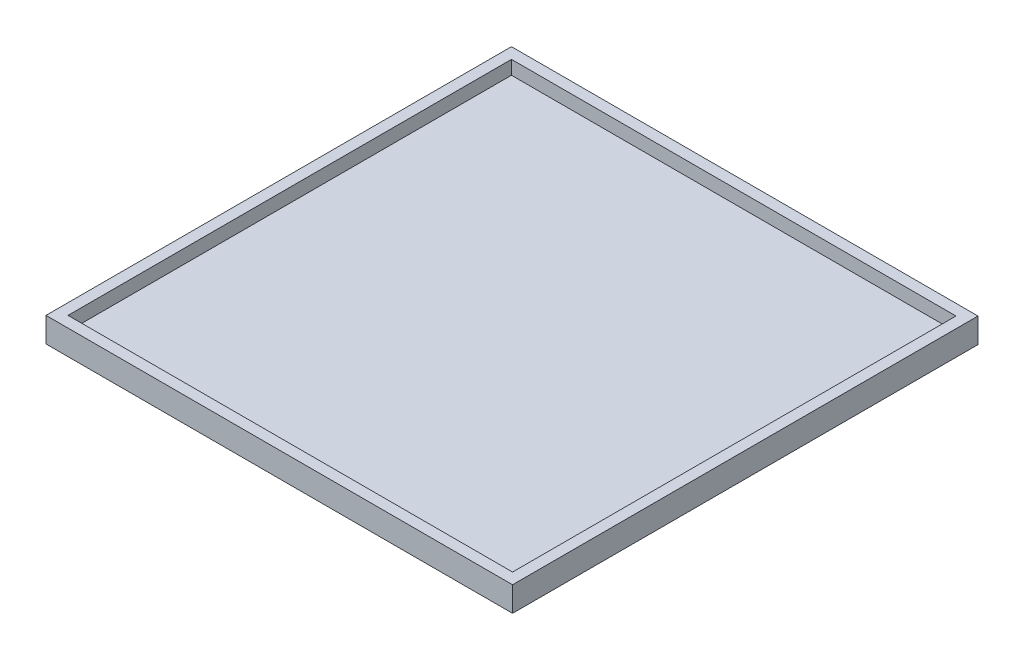
ISO-10303-21;
HEADER;
FILE_DESCRIPTION(('STEP AP214'),'2;1');
FILE_NAME('part.step','',(''),(''),'','','');
FILE_SCHEMA(('AUTOMOTIVE_DESIGN { 1 0 10303 214 1 1 1 1 }'));
ENDSEC;
DATA;
#1=APPLICATION_CONTEXT('core data for automotive mechanical design processes');
#2=APPLICATION_PROTOCOL_DEFINITION('international standard','automotive_design',2000,#1);
#3=PRODUCT_CONTEXT('',#1,'mechanical');
#4=PRODUCT('Part','Part','',(#3));
#5=PRODUCT_RELATED_PRODUCT_CATEGORY('part','',(#4));
#6=PRODUCT_DEFINITION_FORMATION('','',#4);
#7=PRODUCT_DEFINITION_CONTEXT('part definition',#1,'design');
#8=PRODUCT_DEFINITION('design','',#6,#7);
#9=PRODUCT_DEFINITION_SHAPE('','',#8);
#10=(LENGTH_UNIT() NAMED_UNIT(*) SI_UNIT(.MILLI.,.METRE.));
#11=(NAMED_UNIT(*) PLANE_ANGLE_UNIT() SI_UNIT($,.RADIAN.));
#12=(NAMED_UNIT(*) SI_UNIT($,.STERADIAN.) SOLID_ANGLE_UNIT());
#13=UNCERTAINTY_MEASURE_WITH_UNIT(LENGTH_MEASURE(1.E-05),#10,'distance_accuracy_value','');
#14=(GEOMETRIC_REPRESENTATION_CONTEXT(3) GLOBAL_UNCERTAINTY_ASSIGNED_CONTEXT((#13)) GLOBAL_UNIT_ASSIGNED_CONTEXT((#10,
#11,#12)) REPRESENTATION_CONTEXT('',''));
#15=CARTESIAN_POINT('',(0.,0.,0.));
#16=DIRECTION('',(0.,0.,1.));
#17=DIRECTION('',(1.,0.,0.));
#18=AXIS2_PLACEMENT_3D('',#15,#16,#17);
#19=CARTESIAN_POINT('',(0.,31.75,0.));
#20=DIRECTION('',(0.,-1.,0.));
#21=DIRECTION('',(0.,0.,-1.));
#22=AXIS2_PLACEMENT_3D('',#19,#20,#21);
#23=PLANE('',#22);
#24=DIRECTION('',(0.,0.,-1.));
#25=VECTOR('',#24,1.);
#26=CARTESIAN_POINT('',(538.099999998,31.75,0.));
#27=LINE('',#26,#25);
#28=CARTESIAN_POINT('',(538.099999998,31.75,536.829999998));
#29=VERTEX_POINT('',#28);
#30=CARTESIAN_POINT('',(538.099999998,31.75,-536.829999998));
#31=VERTEX_POINT('',#30);
#32=EDGE_CURVE('E168',#29,#31,#27,.T.);
#33=ORIENTED_EDGE('',*,*,#32,.T.);
#34=DIRECTION('',(-1.,0.,0.));
#35=VECTOR('',#34,1.);
#36=CARTESIAN_POINT('',(0.,31.75,-536.829999998));
#37=LINE('',#36,#35);
#38=CARTESIAN_POINT('',(-538.099999998,31.75,-536.829999998));
#39=VERTEX_POINT('',#38);
#40=EDGE_CURVE('E170',#31,#39,#37,.T.);
#41=ORIENTED_EDGE('',*,*,#40,.T.);
#42=DIRECTION('',(0.,0.,1.));
#43=VECTOR('',#42,1.);
#44=CARTESIAN_POINT('',(-538.099999998,31.75,0.));
#45=LINE('',#44,#43);
#46=CARTESIAN_POINT('',(-538.099999998,31.75,536.829999998));
#47=VERTEX_POINT('',#46);
#48=EDGE_CURVE('E171',#39,#47,#45,.T.);
#49=ORIENTED_EDGE('',*,*,#48,.T.);
#50=DIRECTION('',(1.,0.,0.));
#51=VECTOR('',#50,1.);
#52=CARTESIAN_POINT('',(0.,31.75,536.829999998));
#53=LINE('',#52,#51);
#54=EDGE_CURVE('E49',#47,#29,#53,.T.);
#55=ORIENTED_EDGE('',*,*,#54,.T.);
#56=EDGE_LOOP('',(#33,#41,#49,#55));
#57=FACE_BOUND('',#56,.T.);
#58=DIRECTION('',(0.,0.,-1.));
#59=VECTOR('',#58,1.);
#60=CARTESIAN_POINT('',(512.699999998,31.75,511.429999998));
#61=LINE('',#60,#59);
#62=CARTESIAN_POINT('',(512.699999998,31.75,511.429999998));
#63=VERTEX_POINT('',#62);
#64=CARTESIAN_POINT('',(512.699999998,31.75,-511.429999998));
#65=VERTEX_POINT('',#64);
#66=EDGE_CURVE('E114',#63,#65,#61,.T.);
#67=ORIENTED_EDGE('',*,*,#66,.F.);
#68=DIRECTION('',(1.,0.,0.));
#69=VECTOR('',#68,1.);
#70=CARTESIAN_POINT('',(-512.699999998,31.75,511.429999998));
#71=LINE('',#70,#69);
#72=CARTESIAN_POINT('',(-512.699999998,31.75,511.429999998));
#73=VERTEX_POINT('',#72);
#74=EDGE_CURVE('E139',#73,#63,#71,.T.);
#75=ORIENTED_EDGE('',*,*,#74,.F.);
#76=DIRECTION('',(0.,0.,1.));
#77=VECTOR('',#76,1.);
#78=CARTESIAN_POINT('',(-512.699999998,31.75,511.429999998));
#79=LINE('',#78,#77);
#80=CARTESIAN_POINT('',(-512.699999998,31.75,-511.429999998));
#81=VERTEX_POINT('',#80);
#82=EDGE_CURVE('E137',#81,#73,#79,.T.);
#83=ORIENTED_EDGE('',*,*,#82,.F.);
#84=DIRECTION('',(-1.,0.,0.));
#85=VECTOR('',#84,1.);
#86=CARTESIAN_POINT('',(-512.699999998,31.75,-511.429999998));
#87=LINE('',#86,#85);
#88=EDGE_CURVE('E125',#65,#81,#87,.T.);
#89=ORIENTED_EDGE('',*,*,#88,.F.);
#90=EDGE_LOOP('',(#67,#75,#83,#89));
#91=FACE_BOUND('',#90,.T.);
#92=ADVANCED_FACE('F45',(#57,#91),#23,.F.);
#93=CARTESIAN_POINT('',(538.099999998,31.75,511.429999998));
#94=DIRECTION('',(-1.,0.,0.));
#95=DIRECTION('',(0.,0.,1.));
#96=AXIS2_PLACEMENT_3D('',#93,#94,#95);
#97=PLANE('',#96);
#98=DIRECTION('',(0.,0.,-1.));
#99=VECTOR('',#98,1.);
#100=CARTESIAN_POINT('',(538.099999998,-25.4,0.));
#101=LINE('',#100,#99);
#102=CARTESIAN_POINT('',(538.099999998,-25.4,536.829999998));
#103=VERTEX_POINT('',#102);
#104=CARTESIAN_POINT('',(538.099999998,-25.4,-536.829999998));
#105=VERTEX_POINT('',#104);
#106=EDGE_CURVE('E133',#103,#105,#101,.T.);
#107=ORIENTED_EDGE('',*,*,#106,.T.);
#108=DIRECTION('',(0.,-1.,0.));
#109=VECTOR('',#108,1.);
#110=CARTESIAN_POINT('',(538.099999998,31.75,-536.829999998));
#111=LINE('',#110,#109);
#112=EDGE_CURVE('E11',#31,#105,#111,.T.);
#113=ORIENTED_EDGE('',*,*,#112,.F.);
#114=ORIENTED_EDGE('',*,*,#32,.F.);
#115=DIRECTION('',(0.,-1.,0.));
#116=VECTOR('',#115,1.);
#117=CARTESIAN_POINT('',(538.099999998,31.75,536.829999998));
#118=LINE('',#117,#116);
#119=EDGE_CURVE('E155',#29,#103,#118,.T.);
#120=ORIENTED_EDGE('',*,*,#119,.T.);
#121=EDGE_LOOP('',(#107,#113,#114,#120));
#122=FACE_BOUND('',#121,.T.);
#123=ADVANCED_FACE('F185',(#122),#97,.F.);
#124=CARTESIAN_POINT('',(-512.699999998,31.75,-536.829999998));
#125=DIRECTION('',(0.,0.,1.));
#126=DIRECTION('',(1.,0.,0.));
#127=AXIS2_PLACEMENT_3D('',#124,#125,#126);
#128=PLANE('',#127);
#129=DIRECTION('',(-1.,0.,0.));
#130=VECTOR('',#129,1.);
#131=CARTESIAN_POINT('',(0.,-25.4,-536.829999998));
#132=LINE('',#131,#130);
#133=CARTESIAN_POINT('',(-538.099999998,-25.4,-536.829999998));
#134=VERTEX_POINT('',#133);
#135=EDGE_CURVE('E153',#105,#134,#132,.T.);
#136=ORIENTED_EDGE('',*,*,#135,.T.);
#137=DIRECTION('',(0.,-1.,0.));
#138=VECTOR('',#137,1.);
#139=CARTESIAN_POINT('',(-538.099999998,31.75,-536.829999998));
#140=LINE('',#139,#138);
#141=EDGE_CURVE('E54',#39,#134,#140,.T.);
#142=ORIENTED_EDGE('',*,*,#141,.F.);
#143=ORIENTED_EDGE('',*,*,#40,.F.);
#144=ORIENTED_EDGE('',*,*,#112,.T.);
#145=EDGE_LOOP('',(#136,#142,#143,#144));
#146=FACE_BOUND('',#145,.T.);
#147=ADVANCED_FACE('F187',(#146),#128,.F.);
#148=CARTESIAN_POINT('',(-538.099999998,31.75,511.429999998));
#149=DIRECTION('',(1.,0.,0.));
#150=DIRECTION('',(0.,0.,-1.));
#151=AXIS2_PLACEMENT_3D('',#148,#149,#150);
#152=PLANE('',#151);
#153=DIRECTION('',(0.,0.,1.));
#154=VECTOR('',#153,1.);
#155=CARTESIAN_POINT('',(-538.099999998,-25.4,0.));
#156=LINE('',#155,#154);
#157=CARTESIAN_POINT('',(-538.099999998,-25.4,536.829999998));
#158=VERTEX_POINT('',#157);
#159=EDGE_CURVE('E160',#134,#158,#156,.T.);
#160=ORIENTED_EDGE('',*,*,#159,.T.);
#161=DIRECTION('',(0.,-1.,0.));
#162=VECTOR('',#161,1.);
#163=CARTESIAN_POINT('',(-538.099999998,31.75,536.829999998));
#164=LINE('',#163,#162);
#165=EDGE_CURVE('E158',#47,#158,#164,.T.);
#166=ORIENTED_EDGE('',*,*,#165,.F.);
#167=ORIENTED_EDGE('',*,*,#48,.F.);
#168=ORIENTED_EDGE('',*,*,#141,.T.);
#169=EDGE_LOOP('',(#160,#166,#167,#168));
#170=FACE_BOUND('',#169,.T.);
#171=ADVANCED_FACE('F176',(#170),#152,.F.);
#172=CARTESIAN_POINT('',(-512.699999998,31.75,536.829999998));
#173=DIRECTION('',(0.,0.,-1.));
#174=DIRECTION('',(-1.,0.,0.));
#175=AXIS2_PLACEMENT_3D('',#172,#173,#174);
#176=PLANE('',#175);
#177=DIRECTION('',(1.,0.,0.));
#178=VECTOR('',#177,1.);
#179=CARTESIAN_POINT('',(0.,-25.4,536.829999998));
#180=LINE('',#179,#178);
#181=EDGE_CURVE('E164',#158,#103,#180,.T.);
#182=ORIENTED_EDGE('',*,*,#181,.T.);
#183=ORIENTED_EDGE('',*,*,#119,.F.);
#184=ORIENTED_EDGE('',*,*,#54,.F.);
#185=ORIENTED_EDGE('',*,*,#165,.T.);
#186=EDGE_LOOP('',(#182,#183,#184,#185));
#187=FACE_BOUND('',#186,.T.);
#188=ADVANCED_FACE('F180',(#187),#176,.F.);
#189=CARTESIAN_POINT('',(0.,-25.4,0.));
#190=DIRECTION('',(0.,-1.,0.));
#191=DIRECTION('',(0.,0.,-1.));
#192=AXIS2_PLACEMENT_3D('',#189,#190,#191);
#193=PLANE('',#192);
#194=ORIENTED_EDGE('',*,*,#106,.F.);
#195=ORIENTED_EDGE('',*,*,#181,.F.);
#196=ORIENTED_EDGE('',*,*,#159,.F.);
#197=ORIENTED_EDGE('',*,*,#135,.F.);
#198=EDGE_LOOP('',(#194,#195,#196,#197));
#199=FACE_BOUND('',#198,.T.);
#200=ADVANCED_FACE('F47',(#199),#193,.T.);
#201=CARTESIAN_POINT('',(512.699999998,31.75,511.429999998));
#202=DIRECTION('',(-1.,0.,0.));
#203=DIRECTION('',(0.,0.,1.));
#204=AXIS2_PLACEMENT_3D('',#201,#202,#203);
#205=PLANE('',#204);
#206=DIRECTION('',(0.,0.,-1.));
#207=VECTOR('',#206,1.);
#208=CARTESIAN_POINT('',(512.699999998,0.,511.429999998));
#209=LINE('',#208,#207);
#210=CARTESIAN_POINT('',(512.699999998,0.,511.429999998));
#211=VERTEX_POINT('',#210);
#212=CARTESIAN_POINT('',(512.699999998,0.,-511.429999998));
#213=VERTEX_POINT('',#212);
#214=EDGE_CURVE('E143',#211,#213,#209,.T.);
#215=ORIENTED_EDGE('',*,*,#214,.F.);
#216=DIRECTION('',(0.,-1.,0.));
#217=VECTOR('',#216,1.);
#218=CARTESIAN_POINT('',(512.699999998,31.75,511.429999998));
#219=LINE('',#218,#217);
#220=EDGE_CURVE('E121',#63,#211,#219,.T.);
#221=ORIENTED_EDGE('',*,*,#220,.F.);
#222=ORIENTED_EDGE('',*,*,#66,.T.);
#223=DIRECTION('',(0.,-1.,0.));
#224=VECTOR('',#223,1.);
#225=CARTESIAN_POINT('',(512.699999998,31.75,-511.429999998));
#226=LINE('',#225,#224);
#227=EDGE_CURVE('E118',#65,#213,#226,.T.);
#228=ORIENTED_EDGE('',*,*,#227,.T.);
#229=EDGE_LOOP('',(#215,#221,#222,#228));
#230=FACE_BOUND('',#229,.T.);
#231=ADVANCED_FACE('F117',(#230),#205,.T.);
#232=CARTESIAN_POINT('',(-512.699999998,31.75,-511.429999998));
#233=DIRECTION('',(0.,0.,1.));
#234=DIRECTION('',(1.,0.,0.));
#235=AXIS2_PLACEMENT_3D('',#232,#233,#234);
#236=PLANE('',#235);
#237=DIRECTION('',(-1.,0.,0.));
#238=VECTOR('',#237,1.);
#239=CARTESIAN_POINT('',(-512.699999998,0.,-511.429999998));
#240=LINE('',#239,#238);
#241=CARTESIAN_POINT('',(-512.699999998,0.,-511.429999998));
#242=VERTEX_POINT('',#241);
#243=EDGE_CURVE('E132',#213,#242,#240,.T.);
#244=ORIENTED_EDGE('',*,*,#243,.F.);
#245=ORIENTED_EDGE('',*,*,#227,.F.);
#246=ORIENTED_EDGE('',*,*,#88,.T.);
#247=DIRECTION('',(0.,-1.,0.));
#248=VECTOR('',#247,1.);
#249=CARTESIAN_POINT('',(-512.699999998,31.75,-511.429999998));
#250=LINE('',#249,#248);
#251=EDGE_CURVE('E134',#81,#242,#250,.T.);
#252=ORIENTED_EDGE('',*,*,#251,.T.);
#253=EDGE_LOOP('',(#244,#245,#246,#252));
#254=FACE_BOUND('',#253,.T.);
#255=ADVANCED_FACE('F129',(#254),#236,.T.);
#256=CARTESIAN_POINT('',(-512.699999998,31.75,511.429999998));
#257=DIRECTION('',(1.,0.,0.));
#258=DIRECTION('',(0.,0.,-1.));
#259=AXIS2_PLACEMENT_3D('',#256,#257,#258);
#260=PLANE('',#259);
#261=DIRECTION('',(0.,0.,1.));
#262=VECTOR('',#261,1.);
#263=CARTESIAN_POINT('',(-512.699999998,0.,511.429999998));
#264=LINE('',#263,#262);
#265=CARTESIAN_POINT('',(-512.699999998,0.,511.429999998));
#266=VERTEX_POINT('',#265);
#267=EDGE_CURVE('E146',#242,#266,#264,.T.);
#268=ORIENTED_EDGE('',*,*,#267,.F.);
#269=ORIENTED_EDGE('',*,*,#251,.F.);
#270=ORIENTED_EDGE('',*,*,#82,.T.);
#271=DIRECTION('',(0.,-1.,0.));
#272=VECTOR('',#271,1.);
#273=CARTESIAN_POINT('',(-512.699999998,31.75,511.429999998));
#274=LINE('',#273,#272);
#275=EDGE_CURVE('E62',#73,#266,#274,.T.);
#276=ORIENTED_EDGE('',*,*,#275,.T.);
#277=EDGE_LOOP('',(#268,#269,#270,#276));
#278=FACE_BOUND('',#277,.T.);
#279=ADVANCED_FACE('F233',(#278),#260,.T.);
#280=CARTESIAN_POINT('',(-512.699999998,31.75,511.429999998));
#281=DIRECTION('',(0.,0.,-1.));
#282=DIRECTION('',(-1.,0.,0.));
#283=AXIS2_PLACEMENT_3D('',#280,#281,#282);
#284=PLANE('',#283);
#285=DIRECTION('',(1.,0.,0.));
#286=VECTOR('',#285,1.);
#287=CARTESIAN_POINT('',(-512.699999998,0.,511.429999998));
#288=LINE('',#287,#286);
#289=EDGE_CURVE('E126',#266,#211,#288,.T.);
#290=ORIENTED_EDGE('',*,*,#289,.F.);
#291=ORIENTED_EDGE('',*,*,#275,.F.);
#292=ORIENTED_EDGE('',*,*,#74,.T.);
#293=ORIENTED_EDGE('',*,*,#220,.T.);
#294=EDGE_LOOP('',(#290,#291,#292,#293));
#295=FACE_BOUND('',#294,.T.);
#296=ADVANCED_FACE('F241',(#295),#284,.T.);
#297=CARTESIAN_POINT('',(0.,0.,0.));
#298=DIRECTION('',(0.,-1.,0.));
#299=DIRECTION('',(0.,0.,-1.));
#300=AXIS2_PLACEMENT_3D('',#297,#298,#299);
#301=PLANE('',#300);
#302=ORIENTED_EDGE('',*,*,#214,.T.);
#303=ORIENTED_EDGE('',*,*,#243,.T.);
#304=ORIENTED_EDGE('',*,*,#267,.T.);
#305=ORIENTED_EDGE('',*,*,#289,.T.);
#306=EDGE_LOOP('',(#302,#303,#304,#305));
#307=FACE_BOUND('',#306,.T.);
#308=ADVANCED_FACE('F251',(#307),#301,.F.);
#309=CLOSED_SHELL('',(#92,#123,#147,#171,#188,#200,#231,#255,#279,#296,#308));
#310=MANIFOLD_SOLID_BREP('B2',#309);
#311=ADVANCED_BREP_SHAPE_REPRESENTATION('',(#18,#310),#14);
#312=SHAPE_DEFINITION_REPRESENTATION(#9,#311);
ENDSEC;
END-ISO-10303-21;
